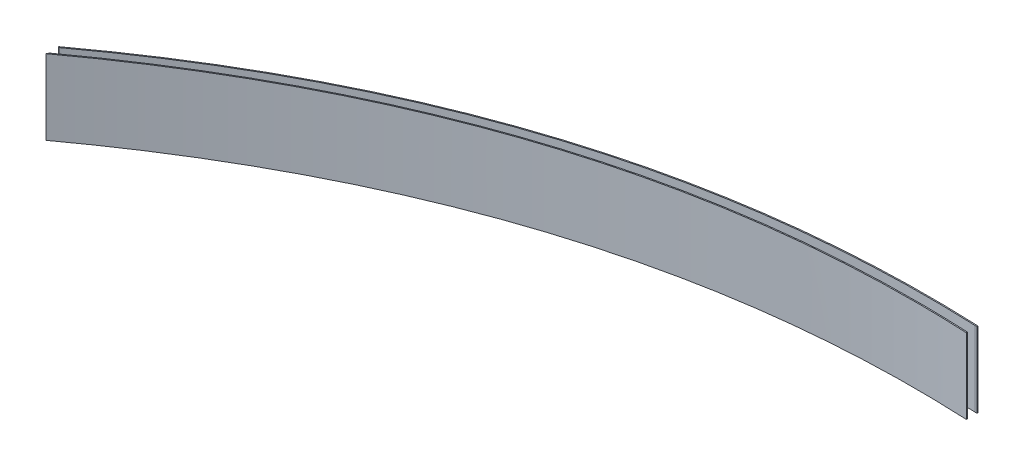
ISO-10303-21;
HEADER;
FILE_DESCRIPTION(('STEP AP214'),'2;1');
FILE_NAME('part.step','',(''),(''),'','','');
FILE_SCHEMA(('AUTOMOTIVE_DESIGN { 1 0 10303 214 1 1 1 1 }'));
ENDSEC;
DATA;
#1=APPLICATION_CONTEXT('core data for automotive mechanical design processes');
#2=APPLICATION_PROTOCOL_DEFINITION('international standard','automotive_design',2000,#1);
#3=PRODUCT_CONTEXT('',#1,'mechanical');
#4=PRODUCT('Part','Part','',(#3));
#5=PRODUCT_RELATED_PRODUCT_CATEGORY('part','',(#4));
#6=PRODUCT_DEFINITION_FORMATION('','',#4);
#7=PRODUCT_DEFINITION_CONTEXT('part definition',#1,'design');
#8=PRODUCT_DEFINITION('design','',#6,#7);
#9=PRODUCT_DEFINITION_SHAPE('','',#8);
#10=(LENGTH_UNIT() NAMED_UNIT(*) SI_UNIT(.MILLI.,.METRE.));
#11=(NAMED_UNIT(*) PLANE_ANGLE_UNIT() SI_UNIT($,.RADIAN.));
#12=(NAMED_UNIT(*) SI_UNIT($,.STERADIAN.) SOLID_ANGLE_UNIT());
#13=UNCERTAINTY_MEASURE_WITH_UNIT(LENGTH_MEASURE(1.E-05),#10,'distance_accuracy_value','');
#14=(GEOMETRIC_REPRESENTATION_CONTEXT(3) GLOBAL_UNCERTAINTY_ASSIGNED_CONTEXT((#13)) GLOBAL_UNIT_ASSIGNED_CONTEXT((#10,
#11,#12)) REPRESENTATION_CONTEXT('',''));
#15=CARTESIAN_POINT('',(0.,0.,0.));
#16=DIRECTION('',(0.,0.,1.));
#17=DIRECTION('',(1.,0.,0.));
#18=AXIS2_PLACEMENT_3D('',#15,#16,#17);
#19=CARTESIAN_POINT('',(-236.084098565073,705.3,330.26408566738));
#20=DIRECTION('',(0.,1.,0.));
#21=DIRECTION('',(0.,0.,1.));
#22=AXIS2_PLACEMENT_3D('',#19,#20,#21);
#23=PLANE('',#22);
#24=CARTESIAN_POINT('',(-65.6029870038505,705.3,318.310693139276));
#25=CARTESIAN_POINT('',(-68.2691629825036,705.3,318.183187046416));
#26=CARTESIAN_POINT('',(-70.9361555522906,705.3,318.073376106954));
#27=CARTESIAN_POINT('',(-76.2713852542856,705.3,317.889522387255));
#28=CARTESIAN_POINT('',(-78.9396223923947,705.3,317.815479778372));
#29=CARTESIAN_POINT('',(-86.9473862895726,705.3,317.647534916938));
#30=CARTESIAN_POINT('',(-92.2881597578225,705.3,317.607902482869));
#31=CARTESIAN_POINT('',(-102.969854987151,705.3,317.676073655154));
#32=CARTESIAN_POINT('',(-108.310776538044,705.3,317.783908630168));
#33=CARTESIAN_POINT('',(-118.988092612427,705.3,318.149436114162));
#34=CARTESIAN_POINT('',(-124.324486600366,705.3,318.407144392248));
#35=CARTESIAN_POINT('',(-134.987971328782,705.3,319.07437400729));
#36=CARTESIAN_POINT('',(-140.315061744115,705.3,319.483900547421));
#37=CARTESIAN_POINT('',(-150.955217209216,705.3,320.456234020843));
#38=CARTESIAN_POINT('',(-156.268282363942,705.3,321.01903980378));
#39=CARTESIAN_POINT('',(-166.725987822131,705.3,322.280831390952));
#40=CARTESIAN_POINT('',(-171.871146588405,705.3,322.975521744442));
#41=CARTESIAN_POINT('',(-182.139119469575,705.3,324.510919792214));
#42=CARTESIAN_POINT('',(-187.261935758724,705.3,325.351612937876));
#43=CARTESIAN_POINT('',(-197.480920878812,705.3,327.178919893074));
#44=CARTESIAN_POINT('',(-202.577092472965,705.3,328.165518247619));
#45=CARTESIAN_POINT('',(-212.738589982239,705.3,330.284063891744));
#46=CARTESIAN_POINT('',(-217.803919000081,705.3,331.415996299166));
#47=CARTESIAN_POINT('',(-227.899635885535,705.3,333.824165958377));
#48=CARTESIAN_POINT('',(-232.930027115684,705.3,335.100389112966));
#49=CARTESIAN_POINT('',(-242.95185071161,705.3,337.795614070396));
#50=CARTESIAN_POINT('',(-247.943286938129,705.3,339.214601525475));
#51=CARTESIAN_POINT('',(-258.337345800253,705.3,342.329437078258));
#52=CARTESIAN_POINT('',(-263.735942949794,705.3,344.038732873943));
#53=CARTESIAN_POINT('',(-274.478583579159,705.3,347.622282235918));
#54=CARTESIAN_POINT('',(-279.822622351469,705.3,349.496549904616));
#55=CARTESIAN_POINT('',(-290.452310891855,705.3,353.406660143415));
#56=CARTESIAN_POINT('',(-295.737950192759,705.3,355.442531159847));
#57=CARTESIAN_POINT('',(-306.247175913095,705.3,359.671966618089));
#58=CARTESIAN_POINT('',(-311.470747397068,705.3,361.865568153882));
#59=CARTESIAN_POINT('',(-321.852374785991,705.3,366.406113074929));
#60=CARTESIAN_POINT('',(-327.010413603648,705.3,368.753095511605));
#61=CARTESIAN_POINT('',(-337.25768706161,705.3,373.595592323015));
#62=CARTESIAN_POINT('',(-342.346905760605,705.3,376.091140411643));
#63=CARTESIAN_POINT('',(-352.613968550303,705.3,381.307086611694));
#64=CARTESIAN_POINT('',(-357.78945789645,705.3,384.032118792804));
#65=CARTESIAN_POINT('',(-368.060581589295,705.3,389.628462780461));
#66=CARTESIAN_POINT('',(-373.156217142842,705.3,392.499772373491));
#67=CARTESIAN_POINT('',(-383.264815106663,705.3,398.382127543981));
#68=CARTESIAN_POINT('',(-388.277793355456,705.3,401.393145919068));
#69=CARTESIAN_POINT('',(-398.218479836666,705.3,407.548011019785));
#70=CARTESIAN_POINT('',(-403.146224129469,705.3,410.691799535078));
#71=CARTESIAN_POINT('',(-412.914028216126,705.3,417.104955927536));
#72=CARTESIAN_POINT('',(-417.754150109865,705.3,420.37422929732));
#73=CARTESIAN_POINT('',(-427.344583874759,705.3,427.030819664629));
#74=CARTESIAN_POINT('',(-432.094989578501,705.3,430.418001436099));
#75=CARTESIAN_POINT('',(-436.802987231457,705.3,433.862922308594));
#76=B_SPLINE_CURVE_WITH_KNOTS('',3,(#24,#25,#26,#27,#28,#29,#30,#31,#32,#33,#34,#35,#36,#37,#38,
#39,#40,#41,#42,#43,#44,#45,#46,#47,#48,#49,#50,#51,#52,#53,#54,#55,#56,#57,#58,#59,#60,#61,#62,
#63,#64,#65,#66,#67,#68,#69,#70,#71,#72,#73,#74,#75),.UNSPECIFIED.,.F.,.F.,(4,2,2,2,2,2,2,2,2,2,
2,2,2,2,2,2,2,2,2,2,2,2,2,2,2,4),(0.,8.00754857334855,16.0151355077293,32.0357311751262,
48.0597352075981,64.0854255306863,80.1116651432765,96.1377844827726,111.711241231546,
127.283147034395,142.853404564952,158.422068976126,173.989213641732,189.554795374637,
206.540261002934,223.527180024817,240.517095839147,257.511020376539,274.509288623075,
291.511429087807,309.056157780186,326.600621058968,344.141682514485,361.675131707691,
379.195625386035,396.696647608506),.UNSPECIFIED.);
#77=CARTESIAN_POINT('',(-65.6029870038505,705.3,318.310693139276));
#78=VERTEX_POINT('',#77);
#79=CARTESIAN_POINT('',(-436.80298723145,705.3,433.862922308592));
#80=VERTEX_POINT('',#79);
#81=EDGE_CURVE('E131',#78,#80,#76,.T.);
#82=ORIENTED_EDGE('',*,*,#81,.T.);
#83=DIRECTION('',(0.452856269308282,0.,-0.891583534700022));
#84=VECTOR('',#83,1.);
#85=CARTESIAN_POINT('',(-353.810815566412,705.3,270.467914266485));
#86=LINE('',#85,#84);
#87=CARTESIAN_POINT('',(-436.202987182509,705.3,432.681642064262));
#88=VERTEX_POINT('',#87);
#89=EDGE_CURVE('E63',#80,#88,#86,.T.);
#90=ORIENTED_EDGE('',*,*,#89,.T.);
#91=CARTESIAN_POINT('',(179399.129928406,705.3,984620.675822957));
#92=CARTESIAN_POINT('',(-212077.093758222,705.3,-976969.386915229));
#93=CARTESIAN_POINT('',(243907.016921872,705.3,970636.245329767));
#94=B_SPLINE_CURVE_WITH_KNOTS('',2,(#91,#92,#93),.UNSPECIFIED.,.F.,.F.,(3,3),(0.,1.),.UNSPECIFIED.);
#95=CARTESIAN_POINT('',(-66.5668764567506,705.3,317.664729887484));
#96=VERTEX_POINT('',#95);
#97=EDGE_CURVE('E162',#96,#88,#94,.F.);
#98=ORIENTED_EDGE('',*,*,#97,.F.);
#99=CARTESIAN_POINT('',(-66.564204214343,705.3,317.664854082143));
#100=VERTEX_POINT('',#99);
#101=EDGE_CURVE('E161',#100,#96,#94,.F.);
#102=ORIENTED_EDGE('',*,*,#101,.F.);
#103=DIRECTION('',(0.998921745490793,0.,0.0464257082404532));
#104=VECTOR('',#103,1.);
#105=CARTESIAN_POINT('',(-66.564204214343,705.3,317.664854082143));
#106=LINE('',#105,#104);
#107=CARTESIAN_POINT('',(-66.2029870059553,705.3,317.681641948464));
#108=VERTEX_POINT('',#107);
#109=EDGE_CURVE('E177',#100,#108,#106,.T.);
#110=ORIENTED_EDGE('',*,*,#109,.T.);
#111=DIRECTION('',(1.,0.,0.));
#112=VECTOR('',#111,1.);
#113=CARTESIAN_POINT('',(-236.084098565073,705.3,317.681641948464));
#114=LINE('',#113,#112);
#115=CARTESIAN_POINT('',(-65.6029870059495,705.3,317.681641948464));
#116=VERTEX_POINT('',#115);
#117=EDGE_CURVE('E97',#108,#116,#114,.T.);
#118=ORIENTED_EDGE('',*,*,#117,.T.);
#119=DIRECTION('',(3.33598704164609E-09,0.,1.));
#120=VECTOR('',#119,1.);
#121=CARTESIAN_POINT('',(-65.6029870059495,705.3,317.681641946463));
#122=LINE('',#121,#120);
#123=EDGE_CURVE('E120',#116,#78,#122,.T.);
#124=ORIENTED_EDGE('',*,*,#123,.T.);
#125=EDGE_LOOP('',(#82,#90,#98,#102,#110,#118,#124));
#126=FACE_BOUND('',#125,.T.);
#127=ADVANCED_FACE('F45',(#126),#23,.F.);
#128=CARTESIAN_POINT('',(-212.010166541518,745.,329.536830566326));
#129=DIRECTION('',(0.,1.,0.));
#130=DIRECTION('',(0.,0.,1.));
#131=AXIS2_PLACEMENT_3D('',#128,#129,#130);
#132=PLANE('',#131);
#133=DIRECTION('',(0.452856269308282,0.,-0.891583534700022));
#134=VECTOR('',#133,1.);
#135=CARTESIAN_POINT('',(-436.202987182509,745.,432.681642064262));
#136=LINE('',#135,#134);
#137=CARTESIAN_POINT('',(-436.80298723145,745.,433.862922308592));
#138=VERTEX_POINT('',#137);
#139=CARTESIAN_POINT('',(-436.202987182509,745.,432.681642064262));
#140=VERTEX_POINT('',#139);
#141=EDGE_CURVE('E12',#138,#140,#136,.T.);
#142=ORIENTED_EDGE('',*,*,#141,.F.);
#143=CARTESIAN_POINT('',(-436.80298723145,745.,433.862922308592));
#144=CARTESIAN_POINT('',(-432.279255756403,745.,430.55283592515));
#145=CARTESIAN_POINT('',(-427.716380805868,745.,427.296059412836));
#146=CARTESIAN_POINT('',(-418.50825169473,745.,420.891282643582));
#147=CARTESIAN_POINT('',(-413.86292067398,745.,417.743392916555));
#148=CARTESIAN_POINT('',(-404.491646218644,745.,411.563075128013));
#149=CARTESIAN_POINT('',(-399.765651911941,745.,408.530724147033));
#150=CARTESIAN_POINT('',(-390.235068970205,745.,402.587926236768));
#151=CARTESIAN_POINT('',(-385.430450818185,745.,399.677526621532));
#152=CARTESIAN_POINT('',(-375.744798513768,745.,393.984783776664));
#153=CARTESIAN_POINT('',(-370.863751469657,745.,391.20246246949));
#154=CARTESIAN_POINT('',(-361.027611925824,745.,385.771719612806));
#155=CARTESIAN_POINT('',(-356.072518596553,745.,383.123299564861));
#156=CARTESIAN_POINT('',(-346.238770653325,745.,378.042292576845));
#157=CARTESIAN_POINT('',(-341.362222313244,745.,375.605630019498));
#158=CARTESIAN_POINT('',(-331.544616363603,745.,370.868404442039));
#159=CARTESIAN_POINT('',(-326.603571709451,745.,368.567814587249));
#160=CARTESIAN_POINT('',(-316.659747663615,745.,364.107101569605));
#161=CARTESIAN_POINT('',(-311.656981986963,745.,361.946947846233));
#162=CARTESIAN_POINT('',(-301.592643904598,745.,357.771088333706));
#163=CARTESIAN_POINT('',(-296.531083180593,745.,355.755354402228));
#164=CARTESIAN_POINT('',(-286.352250622464,745.,351.871919508155));
#165=CARTESIAN_POINT('',(-281.234986407354,745.,350.004198582943));
#166=CARTESIAN_POINT('',(-270.948010590076,745.,346.419961853068));
#167=CARTESIAN_POINT('',(-265.778301322965,745.,344.703439349132));
#168=CARTESIAN_POINT('',(-255.429941826647,745.,341.436991397288));
#169=CARTESIAN_POINT('',(-250.251661926368,745.,339.885892915898));
#170=CARTESIAN_POINT('',(-239.850713429572,745.,336.937627705568));
#171=CARTESIAN_POINT('',(-234.628039042734,745.,335.54048139885));
#172=CARTESIAN_POINT('',(-224.142786614678,745.,332.902097236991));
#173=CARTESIAN_POINT('',(-218.880203866106,745.,331.660878087223));
#174=CARTESIAN_POINT('',(-208.319742254665,745.,329.335763154947));
#175=CARTESIAN_POINT('',(-203.021859272459,745.,328.251886081979));
#176=CARTESIAN_POINT('',(-192.395526399523,745.,326.24230965986));
#177=CARTESIAN_POINT('',(-187.06707294104,745.,325.316629177942));
#178=CARTESIAN_POINT('',(-176.384459892603,745.,323.623741533817));
#179=CARTESIAN_POINT('',(-171.03029752171,745.,322.856551929623));
#180=CARTESIAN_POINT('',(-160.139781371167,745.,321.459677679548));
#181=CARTESIAN_POINT('',(-154.602805468541,745.,320.834841283108));
#182=CARTESIAN_POINT('',(-143.512527106277,745.,319.752161807083));
#183=CARTESIAN_POINT('',(-137.959224503256,745.,319.294320198505));
#184=CARTESIAN_POINT('',(-126.841646292097,745.,318.544085155538));
#185=CARTESIAN_POINT('',(-121.277371038054,745.,318.251686467104));
#186=CARTESIAN_POINT('',(-110.143266246472,745.,317.830220995766));
#187=CARTESIAN_POINT('',(-104.573437348723,745.,317.701137181789));
#188=CARTESIAN_POINT('',(-93.4335333401742,745.,317.603642572535));
#189=CARTESIAN_POINT('',(-87.863458546735,745.,317.635196817593));
#190=CARTESIAN_POINT('',(-79.5119150084561,745.,317.800639622011));
#191=CARTESIAN_POINT('',(-76.7291522792474,745.,317.875448867259));
#192=CARTESIAN_POINT('',(-71.1649597337781,745.,318.063987860901));
#193=CARTESIAN_POINT('',(-68.3835299103828,745.,318.177717398576));
#194=CARTESIAN_POINT('',(-65.6029870038505,745.,318.310693139276));
#195=B_SPLINE_CURVE_WITH_KNOTS('',3,(#143,#144,#145,#146,#147,#148,#149,#150,#151,#152,#153,
#154,#155,#156,#157,#158,#159,#160,#161,#162,#163,#164,#165,#166,#167,#168,#169,#170,#171,#172,
#173,#174,#175,#176,#177,#178,#179,#180,#181,#182,#183,#184,#185,#186,#187,#188,#189,#190,#191,
#192,#193,#194),.UNSPECIFIED.,.F.,.F.,(4,2,2,2,2,2,2,2,2,2,2,2,2,2,2,2,2,2,2,2,2,2,2,2,2,4),(0.,
16.8160550823314,33.6487068955703,50.4923985401429,67.3425657215014,84.1956064097527,
101.04883604582,117.401086820433,133.750101967623,150.095547389379,166.437798948294,
182.777842652134,199.117161999722,215.331599508683,231.548185329037,247.766714673516,
263.987170985665,280.209560473995,296.433746156341,313.147539689226,329.861480445417,
346.574890379593,363.286557234338,379.994587284088,388.345657910788,396.696683324666),.UNSPECIFIED.);
#196=CARTESIAN_POINT('',(-65.6029870038505,745.,318.310693139276));
#197=VERTEX_POINT('',#196);
#198=EDGE_CURVE('E113',#138,#197,#195,.T.);
#199=ORIENTED_EDGE('',*,*,#198,.T.);
#200=DIRECTION('',(-3.33598704164609E-09,0.,-1.));
#201=VECTOR('',#200,1.);
#202=CARTESIAN_POINT('',(-65.6029869664008,745.,329.536830077914));
#203=LINE('',#202,#201);
#204=CARTESIAN_POINT('',(-65.6029870038505,745.,317.681641948464));
#205=VERTEX_POINT('',#204);
#206=EDGE_CURVE('E49',#197,#205,#203,.T.);
#207=ORIENTED_EDGE('',*,*,#206,.T.);
#208=DIRECTION('',(1.,0.,0.));
#209=VECTOR('',#208,1.);
#210=CARTESIAN_POINT('',(-66.2029870059495,745.,317.681641948464));
#211=LINE('',#210,#209);
#212=CARTESIAN_POINT('',(-66.2029870059495,745.,317.681641948464));
#213=VERTEX_POINT('',#212);
#214=EDGE_CURVE('E179',#213,#205,#211,.T.);
#215=ORIENTED_EDGE('',*,*,#214,.F.);
#216=DIRECTION('',(0.998921745490792,0.,0.0464257082404641));
#217=VECTOR('',#216,1.);
#218=CARTESIAN_POINT('',(-66.5642042129753,745.,317.664854082207));
#219=LINE('',#218,#217);
#220=CARTESIAN_POINT('',(-66.5668764558678,745.,317.664729884103));
#221=VERTEX_POINT('',#220);
#222=EDGE_CURVE('E122',#213,#221,#219,.F.);
#223=ORIENTED_EDGE('',*,*,#222,.T.);
#224=CARTESIAN_POINT('',(179399.129928406,745.,984620.675822957));
#225=CARTESIAN_POINT('',(-212077.093758222,745.,-976969.386915229));
#226=CARTESIAN_POINT('',(243907.016921872,745.,970636.245329767));
#227=B_SPLINE_CURVE_WITH_KNOTS('',2,(#224,#225,#226),.UNSPECIFIED.,.F.,.F.,(3,3),(0.,1.),.UNSPECIFIED.);
#228=EDGE_CURVE('E115',#140,#221,#227,.T.);
#229=ORIENTED_EDGE('',*,*,#228,.F.);
#230=EDGE_LOOP('',(#142,#199,#207,#215,#223,#229));
#231=FACE_BOUND('',#230,.T.);
#232=ADVANCED_FACE('F111',(#231),#132,.T.);
#233=CARTESIAN_POINT('',(179399.129928406,314.960432392313,984620.675822957));
#234=CARTESIAN_POINT('',(-212077.093758222,314.960432392313,-976969.386915229));
#235=CARTESIAN_POINT('',(243907.016921872,314.960432392313,970636.245329767));
#236=B_SPLINE_CURVE_WITH_KNOTS('',2,(#233,#234,#235),.UNSPECIFIED.,.F.,.F.,(3,3),(0.,1.),.UNSPECIFIED.);
#237=DIRECTION('',(0.,1.,0.));
#238=VECTOR('',#237,1.);
#239=SURFACE_OF_LINEAR_EXTRUSION('',#236,#238);
#240=OFFSET_SURFACE('',#239,0.6,.F.);
#241=ORIENTED_EDGE('',*,*,#81,.F.);
#242=DIRECTION('',(0.,1.,0.));
#243=VECTOR('',#242,1.);
#244=CARTESIAN_POINT('',(-65.6029870038505,705.3,318.310693139276));
#245=LINE('',#244,#243);
#246=EDGE_CURVE('E118',#78,#197,#245,.T.);
#247=ORIENTED_EDGE('',*,*,#246,.T.);
#248=ORIENTED_EDGE('',*,*,#198,.F.);
#249=DIRECTION('',(0.,1.,0.));
#250=VECTOR('',#249,1.);
#251=CARTESIAN_POINT('',(-436.802987231448,705.3,433.862922308592));
#252=LINE('',#251,#250);
#253=EDGE_CURVE('E55',#80,#138,#252,.T.);
#254=ORIENTED_EDGE('',*,*,#253,.F.);
#255=EDGE_LOOP('',(#241,#247,#248,#254));
#256=FACE_BOUND('',#255,.T.);
#257=ADVANCED_FACE('F116',(#256),#240,.T.);
#258=CARTESIAN_POINT('',(-65.6029870059495,314.960432392313,317.681641946463));
#259=DIRECTION('',(1.,0.,-3.33598704164609E-09));
#260=DIRECTION('',(-3.33598704164609E-09,0.,-1.));
#261=AXIS2_PLACEMENT_3D('',#258,#259,#260);
#262=PLANE('',#261);
#263=DIRECTION('',(0.,-1.,0.));
#264=VECTOR('',#263,1.);
#265=CARTESIAN_POINT('',(-65.6029870059495,314.960432392313,317.681641948464));
#266=LINE('',#265,#264);
#267=EDGE_CURVE('E106',#205,#116,#266,.T.);
#268=ORIENTED_EDGE('',*,*,#267,.F.);
#269=ORIENTED_EDGE('',*,*,#206,.F.);
#270=ORIENTED_EDGE('',*,*,#246,.F.);
#271=ORIENTED_EDGE('',*,*,#123,.F.);
#272=EDGE_LOOP('',(#268,#269,#270,#271));
#273=FACE_BOUND('',#272,.T.);
#274=ADVANCED_FACE('F141',(#273),#262,.T.);
#275=CARTESIAN_POINT('',(179399.129928406,314.960432392313,984620.675822957));
#276=CARTESIAN_POINT('',(-212077.093758222,314.960432392313,-976969.386915229));
#277=CARTESIAN_POINT('',(243907.016921872,314.960432392313,970636.245329767));
#278=B_SPLINE_CURVE_WITH_KNOTS('',2,(#275,#276,#277),.UNSPECIFIED.,.F.,.F.,(3,3),(0.,1.),.UNSPECIFIED.);
#279=DIRECTION('',(0.,1.,0.));
#280=VECTOR('',#279,1.);
#281=SURFACE_OF_LINEAR_EXTRUSION('',#278,#280);
#282=ORIENTED_EDGE('',*,*,#228,.T.);
#283=DIRECTION('',(0.,1.,0.));
#284=VECTOR('',#283,1.);
#285=CARTESIAN_POINT('',(-66.5668764567506,685.,317.664729887484));
#286=LINE('',#285,#284);
#287=EDGE_CURVE('E182',#96,#221,#286,.T.);
#288=ORIENTED_EDGE('',*,*,#287,.F.);
#289=ORIENTED_EDGE('',*,*,#97,.T.);
#290=DIRECTION('',(0.,1.,0.));
#291=VECTOR('',#290,1.);
#292=CARTESIAN_POINT('',(-436.202987182509,314.960432392313,432.681642064262));
#293=LINE('',#292,#291);
#294=EDGE_CURVE('E156',#88,#140,#293,.T.);
#295=ORIENTED_EDGE('',*,*,#294,.T.);
#296=EDGE_LOOP('',(#282,#288,#289,#295));
#297=FACE_BOUND('',#296,.T.);
#298=ADVANCED_FACE('F142',(#297),#281,.F.);
#299=CARTESIAN_POINT('',(-66.5668764567506,685.,317.664729887484));
#300=DIRECTION('',(-0.0464257082403459,0.,0.998921745490798));
#301=DIRECTION('',(0.998921745490798,0.,0.0464257082403459));
#302=AXIS2_PLACEMENT_3D('',#299,#300,#301);
#303=PLANE('',#302);
#304=ORIENTED_EDGE('',*,*,#101,.T.);
#305=ORIENTED_EDGE('',*,*,#287,.T.);
#306=ORIENTED_EDGE('',*,*,#222,.F.);
#307=DIRECTION('',(0.,1.,0.));
#308=VECTOR('',#307,1.);
#309=CARTESIAN_POINT('',(-66.2029870059495,685.,317.681641948464));
#310=LINE('',#309,#308);
#311=EDGE_CURVE('E180',#108,#213,#310,.T.);
#312=ORIENTED_EDGE('',*,*,#311,.F.);
#313=ORIENTED_EDGE('',*,*,#109,.F.);
#314=EDGE_LOOP('',(#304,#305,#306,#312,#313));
#315=FACE_BOUND('',#314,.T.);
#316=ADVANCED_FACE('F148',(#315),#303,.F.);
#317=CARTESIAN_POINT('',(-66.2029870059495,685.,317.681641948464));
#318=DIRECTION('',(0.,0.,1.));
#319=DIRECTION('',(1.,0.,0.));
#320=AXIS2_PLACEMENT_3D('',#317,#318,#319);
#321=PLANE('',#320);
#322=ORIENTED_EDGE('',*,*,#311,.T.);
#323=ORIENTED_EDGE('',*,*,#214,.T.);
#324=ORIENTED_EDGE('',*,*,#267,.T.);
#325=ORIENTED_EDGE('',*,*,#117,.F.);
#326=EDGE_LOOP('',(#322,#323,#324,#325));
#327=FACE_BOUND('',#326,.T.);
#328=ADVANCED_FACE('F197',(#327),#321,.F.);
#329=CARTESIAN_POINT('',(-436.202987182509,685.,432.681642064262));
#330=DIRECTION('',(0.891583534700022,0.,0.452856269308282));
#331=DIRECTION('',(0.452856269308282,0.,-0.891583534700022));
#332=AXIS2_PLACEMENT_3D('',#329,#330,#331);
#333=PLANE('',#332);
#334=ORIENTED_EDGE('',*,*,#253,.T.);
#335=ORIENTED_EDGE('',*,*,#141,.T.);
#336=ORIENTED_EDGE('',*,*,#294,.F.);
#337=ORIENTED_EDGE('',*,*,#89,.F.);
#338=EDGE_LOOP('',(#334,#335,#336,#337));
#339=FACE_BOUND('',#338,.T.);
#340=ADVANCED_FACE('F101',(#339),#333,.F.);
#341=CLOSED_SHELL('',(#127,#232,#257,#274,#298,#316,#328,#340));
#342=MANIFOLD_SOLID_BREP('B2',#341);
#343=CARTESIAN_POINT('',(-65.6029870059495,314.960432392313,317.681641946463));
#344=DIRECTION('',(1.,0.,-3.33598704164609E-09));
#345=DIRECTION('',(-3.33598704164609E-09,0.,-1.));
#346=AXIS2_PLACEMENT_3D('',#343,#344,#345);
#347=PLANE('',#346);
#348=DIRECTION('',(0.,1.,0.));
#349=VECTOR('',#348,1.);
#350=CARTESIAN_POINT('',(-65.6029870226558,314.960432392313,312.673734300305));
#351=LINE('',#350,#349);
#352=CARTESIAN_POINT('',(-65.6029870226558,705.3,312.673734300305));
#353=VERTEX_POINT('',#352);
#354=CARTESIAN_POINT('',(-65.6029870038505,745.,312.673734300454));
#355=VERTEX_POINT('',#354);
#356=EDGE_CURVE('E326',#353,#355,#351,.T.);
#357=ORIENTED_EDGE('',*,*,#356,.F.);
#358=DIRECTION('',(3.33598704164609E-09,0.,1.));
#359=VECTOR('',#358,1.);
#360=CARTESIAN_POINT('',(-65.6029870059495,705.3,317.681641946463));
#361=LINE('',#360,#359);
#362=CARTESIAN_POINT('',(-65.6029870245489,705.3,312.107195518563));
#363=VERTEX_POINT('',#362);
#364=EDGE_CURVE('E263',#363,#353,#361,.T.);
#365=ORIENTED_EDGE('',*,*,#364,.F.);
#366=DIRECTION('',(0.,1.,0.));
#367=VECTOR('',#366,1.);
#368=CARTESIAN_POINT('',(-65.6029870245489,705.3,312.107195518563));
#369=LINE('',#368,#367);
#370=CARTESIAN_POINT('',(-65.6029870245519,745.,312.107195518563));
#371=VERTEX_POINT('',#370);
#372=EDGE_CURVE('E370',#363,#371,#369,.T.);
#373=ORIENTED_EDGE('',*,*,#372,.T.);
#374=DIRECTION('',(-3.33598704164609E-09,0.,-1.));
#375=VECTOR('',#374,1.);
#376=CARTESIAN_POINT('',(-65.6029869664008,745.,329.536830077914));
#377=LINE('',#376,#375);
#378=EDGE_CURVE('E371',#355,#371,#377,.T.);
#379=ORIENTED_EDGE('',*,*,#378,.F.);
#380=EDGE_LOOP('',(#357,#365,#373,#379));
#381=FACE_BOUND('',#380,.T.);
#382=ADVANCED_FACE('F256',(#381),#347,.T.);
#383=CARTESIAN_POINT('',(-64.608203727472,685.,312.681641947686));
#384=DIRECTION('',(0.00794886443687775,0.,-0.999968407278032));
#385=DIRECTION('',(-0.999968407278032,0.,-0.00794886443687775));
#386=AXIS2_PLACEMENT_3D('',#383,#384,#385);
#387=PLANE('',#386);
#388=ORIENTED_EDGE('',*,*,#356,.T.);
#389=DIRECTION('',(-0.999968407278032,0.,-0.00794886443687775));
#390=VECTOR('',#389,1.);
#391=CARTESIAN_POINT('',(-64.608203727472,745.,312.681641947686));
#392=LINE('',#391,#390);
#393=CARTESIAN_POINT('',(-66.5668770191505,745.,312.666072207901));
#394=VERTEX_POINT('',#393);
#395=EDGE_CURVE('E270',#355,#394,#392,.T.);
#396=ORIENTED_EDGE('',*,*,#395,.T.);
#397=DIRECTION('',(0.,1.,0.));
#398=VECTOR('',#397,1.);
#399=CARTESIAN_POINT('',(-66.5668764567364,725.15,312.666072231805));
#400=LINE('',#399,#398);
#401=CARTESIAN_POINT('',(-66.5668764567506,705.3,312.666072231795));
#402=VERTEX_POINT('',#401);
#403=EDGE_CURVE('E43',#402,#394,#400,.T.);
#404=ORIENTED_EDGE('',*,*,#403,.F.);
#405=DIRECTION('',(-0.999968407278032,0.,-0.00794886443687775));
#406=VECTOR('',#405,1.);
#407=CARTESIAN_POINT('',(-235.9335079095,705.3,311.319757304493));
#408=LINE('',#407,#406);
#409=EDGE_CURVE('E323',#353,#402,#408,.T.);
#410=ORIENTED_EDGE('',*,*,#409,.F.);
#411=EDGE_LOOP('',(#388,#396,#404,#410));
#412=FACE_BOUND('',#411,.T.);
#413=ADVANCED_FACE('F350',(#412),#387,.F.);
#414=CARTESIAN_POINT('',(285136.696023591,314.960432392313,959317.615852084));
#415=CARTESIAN_POINT('',(-253607.150543159,314.960432392313,-967038.901584155));
#416=CARTESIAN_POINT('',(221133.268668467,314.960432392313,976081.243658898));
#417=B_SPLINE_CURVE_WITH_KNOTS('',2,(#414,#415,#416),.UNSPECIFIED.,.F.,.F.,(3,3),(0.,1.),.UNSPECIFIED.);
#418=DIRECTION('',(0.,1.,0.));
#419=VECTOR('',#418,1.);
#420=SURFACE_OF_LINEAR_EXTRUSION('',#417,#419);
#421=CARTESIAN_POINT('',(285136.696023591,705.3,959317.615852084));
#422=CARTESIAN_POINT('',(-253607.150543159,705.3,-967038.901584155));
#423=CARTESIAN_POINT('',(221133.268668467,705.3,976081.243658898));
#424=B_SPLINE_CURVE_WITH_KNOTS('',2,(#421,#422,#423),.UNSPECIFIED.,.F.,.F.,(3,3),(0.,1.),.UNSPECIFIED.);
#425=CARTESIAN_POINT('',(-436.202986975316,705.3,427.681641912946));
#426=VERTEX_POINT('',#425);
#427=EDGE_CURVE('E312',#426,#402,#424,.F.);
#428=ORIENTED_EDGE('',*,*,#427,.T.);
#429=ORIENTED_EDGE('',*,*,#403,.T.);
#430=CARTESIAN_POINT('',(285136.696023591,745.,959317.615852084));
#431=CARTESIAN_POINT('',(-253607.150543159,745.,-967038.901584155));
#432=CARTESIAN_POINT('',(221133.268668467,745.,976081.243658898));
#433=B_SPLINE_CURVE_WITH_KNOTS('',2,(#430,#431,#432),.UNSPECIFIED.,.F.,.F.,(3,3),(0.,1.),.UNSPECIFIED.);
#434=CARTESIAN_POINT('',(-436.202986975374,745.,427.681641912883));
#435=VERTEX_POINT('',#434);
#436=EDGE_CURVE('E313',#394,#435,#433,.T.);
#437=ORIENTED_EDGE('',*,*,#436,.T.);
#438=DIRECTION('',(0.,1.,0.));
#439=VECTOR('',#438,1.);
#440=CARTESIAN_POINT('',(-436.202986975374,314.960432392313,427.681641912883));
#441=LINE('',#440,#439);
#442=EDGE_CURVE('E302',#426,#435,#441,.T.);
#443=ORIENTED_EDGE('',*,*,#442,.F.);
#444=EDGE_LOOP('',(#428,#429,#437,#443));
#445=FACE_BOUND('',#444,.T.);
#446=ADVANCED_FACE('F322',(#445),#420,.F.);
#447=CARTESIAN_POINT('',(-212.010166541518,745.,329.536830566326));
#448=DIRECTION('',(0.,1.,0.));
#449=DIRECTION('',(0.,0.,1.));
#450=AXIS2_PLACEMENT_3D('',#447,#448,#449);
#451=PLANE('',#450);
#452=DIRECTION('',(-0.892730946928028,0.,-0.450590120172409));
#453=VECTOR('',#452,1.);
#454=CARTESIAN_POINT('',(-436.202986975374,745.,427.681641912883));
#455=LINE('',#454,#453);
#456=CARTESIAN_POINT('',(-436.802986962826,745.,427.378802555315));
#457=VERTEX_POINT('',#456);
#458=EDGE_CURVE('E305',#435,#457,#455,.T.);
#459=ORIENTED_EDGE('',*,*,#458,.F.);
#460=ORIENTED_EDGE('',*,*,#436,.F.);
#461=ORIENTED_EDGE('',*,*,#395,.F.);
#462=ORIENTED_EDGE('',*,*,#378,.T.);
#463=CARTESIAN_POINT('',(-65.6029870245519,745.,312.107195518563));
#464=CARTESIAN_POINT('',(-68.8360655848659,745.,311.96495440707));
#465=CARTESIAN_POINT('',(-72.0701963345177,745.,311.847702251562));
#466=CARTESIAN_POINT('',(-78.5399250136832,745.,311.663890674077));
#467=CARTESIAN_POINT('',(-81.7755229559784,745.,311.597331702551));
#468=CARTESIAN_POINT('',(-91.4870116238964,745.,311.474725307814));
#469=CARTESIAN_POINT('',(-97.9640627894625,745.,311.495905433628));
#470=CARTESIAN_POINT('',(-110.916019717675,745.,311.749375253086));
#471=CARTESIAN_POINT('',(-117.390924154514,745.,311.981731692027));
#472=CARTESIAN_POINT('',(-130.330312835101,745.,312.662159463947));
#473=CARTESIAN_POINT('',(-136.794795612366,745.,313.110258879267));
#474=CARTESIAN_POINT('',(-149.704921693366,745.,314.225842725688));
#475=CARTESIAN_POINT('',(-156.150564782858,745.,314.89332964193));
#476=CARTESIAN_POINT('',(-168.830746909082,745.,316.428093282491));
#477=CARTESIAN_POINT('',(-175.066044665544,745.,317.28910012314));
#478=CARTESIAN_POINT('',(-187.502902508504,745.,319.222078009508));
#479=CARTESIAN_POINT('',(-193.704467648199,745.,320.294016509993));
#480=CARTESIAN_POINT('',(-206.066302262224,745.,322.649348069743));
#481=CARTESIAN_POINT('',(-212.226578159184,745.,323.932707408446));
#482=CARTESIAN_POINT('',(-224.498496892596,745.,326.710404031752));
#483=CARTESIAN_POINT('',(-230.610146348949,745.,328.20471206052));
#484=CARTESIAN_POINT('',(-242.77764624419,745.,331.402837721937));
#485=CARTESIAN_POINT('',(-248.833502703756,745.,333.106632457142));
#486=CARTESIAN_POINT('',(-261.303206849177,745.,336.847515389385));
#487=CARTESIAN_POINT('',(-267.712572620807,745.,338.899559709637));
#488=CARTESIAN_POINT('',(-280.452807413354,745.,343.236946063103));
#489=CARTESIAN_POINT('',(-286.783665511531,745.,345.522320159905));
#490=CARTESIAN_POINT('',(-299.359842608097,745.,350.321362762269));
#491=CARTESIAN_POINT('',(-305.605142185614,745.,352.835082143115));
#492=CARTESIAN_POINT('',(-318.0035593631,745.,358.084740034403));
#493=CARTESIAN_POINT('',(-324.156651845315,745.,360.820737836763));
#494=CARTESIAN_POINT('',(-336.364426133074,745.,366.507845131743));
#495=CARTESIAN_POINT('',(-342.419082793259,745.,369.459008564271));
#496=CARTESIAN_POINT('',(-354.613126433797,745.,375.664526043001));
#497=CARTESIAN_POINT('',(-360.749134311021,745.,378.925518160327));
#498=CARTESIAN_POINT('',(-372.90424055894,745.,385.657816073886));
#499=CARTESIAN_POINT('',(-378.923343885706,745.,389.12911292861));
#500=CARTESIAN_POINT('',(-390.839530252551,745.,396.271325078874));
#501=CARTESIAN_POINT('',(-396.736646717361,745.,399.942184666095));
#502=CARTESIAN_POINT('',(-408.404397200775,745.,407.472123920745));
#503=CARTESIAN_POINT('',(-414.175106467215,745.,411.33108694291));
#504=CARTESIAN_POINT('',(-422.734475326974,745.,417.252375584052));
#505=CARTESIAN_POINT('',(-425.570058564693,745.,419.247226242331));
#506=CARTESIAN_POINT('',(-431.209965781376,745.,423.280573146121));
#507=CARTESIAN_POINT('',(-434.014290122211,745.,425.319068885572));
#508=CARTESIAN_POINT('',(-436.802986962826,745.,427.378802555315));
#509=B_SPLINE_CURVE_WITH_KNOTS('',3,(#463,#464,#465,#466,#467,#468,#469,#470,#471,#472,#473,
#474,#475,#476,#477,#478,#479,#480,#481,#482,#483,#484,#485,#486,#487,#488,#489,#490,#491,#492,
#493,#494,#495,#496,#497,#498,#499,#500,#501,#502,#503,#504,#505,#506,#507,#508),.UNSPECIFIED.,
.F.,.F.,(4,2,2,2,2,2,2,2,2,2,2,2,2,2,2,2,2,2,2,2,2,2,4),(0.,9.70842084142319,19.4169279493336,
38.8445510406184,58.2783166464797,77.7146125465992,97.151128621337,116.030950401179,
134.907861441507,153.781764619089,172.653052799137,191.522280128832,211.707236019532,
231.89496941882,252.087211724763,272.284858031249,292.48758521538,313.329439794875,
334.170408864022,355.005589715533,375.828010822125,386.228600761917,396.6290701731),.UNSPECIFIED.);
#510=EDGE_CURVE('E320',#371,#457,#509,.T.);
#511=ORIENTED_EDGE('',*,*,#510,.T.);
#512=EDGE_LOOP('',(#459,#460,#461,#462,#511));
#513=FACE_BOUND('',#512,.T.);
#514=ADVANCED_FACE('F318',(#513),#451,.T.);
#515=CARTESIAN_POINT('',(285136.696023591,314.960432392313,959317.615852084));
#516=CARTESIAN_POINT('',(-253607.150543159,314.960432392313,-967038.901584155));
#517=CARTESIAN_POINT('',(221133.268668467,314.960432392313,976081.243658898));
#518=B_SPLINE_CURVE_WITH_KNOTS('',2,(#515,#516,#517),.UNSPECIFIED.,.F.,.F.,(3,3),(0.,1.),.UNSPECIFIED.);
#519=DIRECTION('',(0.,1.,0.));
#520=VECTOR('',#519,1.);
#521=SURFACE_OF_LINEAR_EXTRUSION('',#518,#520);
#522=OFFSET_SURFACE('',#521,0.6,.F.);
#523=CARTESIAN_POINT('',(-436.802986962826,705.3,427.378802555315));
#524=CARTESIAN_POINT('',(-432.357573914022,705.3,424.095380200365));
#525=CARTESIAN_POINT('',(-427.872237236557,705.3,420.865836271993));
#526=CARTESIAN_POINT('',(-418.818627721933,705.3,414.516948944963));
#527=CARTESIAN_POINT('',(-414.250288312721,705.3,411.397700501685));
#528=CARTESIAN_POINT('',(-405.032523436767,705.3,405.275700479121));
#529=CARTESIAN_POINT('',(-400.3830546593,705.3,402.273014066987));
#530=CARTESIAN_POINT('',(-391.005157561634,705.3,396.390146252628));
#531=CARTESIAN_POINT('',(-386.276704610613,705.3,393.510004097315));
#532=CARTESIAN_POINT('',(-376.743144840293,705.3,387.877915826974));
#533=CARTESIAN_POINT('',(-371.938027563969,705.3,385.125987404507));
#534=CARTESIAN_POINT('',(-362.253657075411,705.3,379.755677939082));
#535=CARTESIAN_POINT('',(-357.374403396732,705.3,377.137297736822));
#536=CARTESIAN_POINT('',(-347.688476837849,705.3,372.113746430338));
#537=CARTESIAN_POINT('',(-342.883880461363,705.3,369.704572155707));
#538=CARTESIAN_POINT('',(-333.210395160166,705.3,365.021109531586));
#539=CARTESIAN_POINT('',(-328.341517615143,705.3,362.746797688732));
#540=CARTESIAN_POINT('',(-318.542434110656,705.3,358.336908741613));
#541=CARTESIAN_POINT('',(-313.612240064375,705.3,356.201305174345));
#542=CARTESIAN_POINT('',(-303.693651471857,705.3,352.072273212178));
#543=CARTESIAN_POINT('',(-298.705267122614,705.3,350.078820330333));
#544=CARTESIAN_POINT('',(-288.673599750786,705.3,346.23711422357));
#545=CARTESIAN_POINT('',(-283.630323706244,705.3,344.388842782517));
#546=CARTESIAN_POINT('',(-273.492357977128,705.3,340.840097233906));
#547=CARTESIAN_POINT('',(-268.397671287743,705.3,339.139614571009));
#548=CARTESIAN_POINT('',(-258.057204568689,705.3,335.855788058485));
#549=CARTESIAN_POINT('',(-252.810451781993,705.3,334.275505948789));
#550=CARTESIAN_POINT('',(-242.271259471402,705.3,331.272804524742));
#551=CARTESIAN_POINT('',(-236.978814328544,705.3,329.850404932629));
#552=CARTESIAN_POINT('',(-226.352896276705,705.3,327.164882799336));
#553=CARTESIAN_POINT('',(-221.019417853299,705.3,325.901782077386));
#554=CARTESIAN_POINT('',(-210.316224324602,705.3,323.535704103402));
#555=CARTESIAN_POINT('',(-204.946503879948,705.3,322.432751008904));
#556=CARTESIAN_POINT('',(-194.175737993602,705.3,320.387249576568));
#557=CARTESIAN_POINT('',(-188.774687794206,705.3,319.444726297834));
#558=CARTESIAN_POINT('',(-177.946306240679,705.3,317.719808844371));
#559=CARTESIAN_POINT('',(-172.518971242643,705.3,316.937437562378));
#560=CARTESIAN_POINT('',(-161.476559328314,705.3,315.510469369479));
#561=CARTESIAN_POINT('',(-155.860839527086,705.3,314.87084662983));
#562=CARTESIAN_POINT('',(-144.612838226447,705.3,313.759323138391));
#563=CARTESIAN_POINT('',(-138.980556671698,705.3,313.287422947669));
#564=CARTESIAN_POINT('',(-127.704998046978,705.3,312.509209922284));
#565=CARTESIAN_POINT('',(-122.06172180838,705.3,312.20288502066));
#566=CARTESIAN_POINT('',(-110.769804730855,705.3,311.753137560255));
#567=CARTESIAN_POINT('',(-105.121165112379,705.3,311.609684116282));
#568=CARTESIAN_POINT('',(-93.8240464001927,705.3,311.482475038795));
#569=CARTESIAN_POINT('',(-88.1755679602751,705.3,311.498662775895));
#570=CARTESIAN_POINT('',(-79.7065930225129,705.3,311.639941055241));
#571=CARTESIAN_POINT('',(-76.8849991447583,705.3,311.706498951784));
#572=CARTESIAN_POINT('',(-71.2429977649209,705.3,311.878101623423));
#573=CARTESIAN_POINT('',(-68.4225902558612,705.3,311.983146168928));
#574=CARTESIAN_POINT('',(-65.6029870245489,705.3,312.107195518563));
#575=B_SPLINE_CURVE_WITH_KNOTS('',3,(#523,#524,#525,#526,#527,#528,#529,#530,#531,#532,#533,
#534,#535,#536,#537,#538,#539,#540,#541,#542,#543,#544,#545,#546,#547,#548,#549,#550,#551,#552,
#553,#554,#555,#556,#557,#558,#559,#560,#561,#562,#563,#564,#565,#566,#567,#568,#569,#570,#571,
#572,#573,#574),.UNSPECIFIED.,.F.,.F.,(4,2,2,2,2,2,2,2,2,2,2,2,2,2,2,2,2,2,2,2,2,2,2,2,2,4),(0.,
16.579343528591,33.1726292152399,49.7750620045053,66.3827725892805,82.9927681701557,
99.6028682994412,115.725178476675,131.844671807081,147.96108074447,164.074706721334,
180.186307656916,196.296975286528,212.733223248817,229.171522075587,245.612070022965,
262.055095380917,278.500686783754,294.948627343037,311.902149917432,328.855729204329,
345.808072764746,362.757201127804,379.700317356698,388.167228610641,396.63408935612),.UNSPECIFIED.);
#576=CARTESIAN_POINT('',(-436.802986962826,705.3,427.378802555315));
#577=VERTEX_POINT('',#576);
#578=EDGE_CURVE('E278',#577,#363,#575,.T.);
#579=ORIENTED_EDGE('',*,*,#578,.F.);
#580=DIRECTION('',(0.,1.,0.));
#581=VECTOR('',#580,1.);
#582=CARTESIAN_POINT('',(-436.802986962826,705.3,427.378802555315));
#583=LINE('',#582,#581);
#584=EDGE_CURVE('E341',#577,#457,#583,.T.);
#585=ORIENTED_EDGE('',*,*,#584,.T.);
#586=ORIENTED_EDGE('',*,*,#510,.F.);
#587=ORIENTED_EDGE('',*,*,#372,.F.);
#588=EDGE_LOOP('',(#579,#585,#586,#587));
#589=FACE_BOUND('',#588,.T.);
#590=ADVANCED_FACE('F353',(#589),#522,.T.);
#591=CARTESIAN_POINT('',(-236.084098565073,705.3,330.26408566738));
#592=DIRECTION('',(0.,1.,0.));
#593=DIRECTION('',(0.,0.,1.));
#594=AXIS2_PLACEMENT_3D('',#591,#592,#593);
#595=PLANE('',#594);
#596=ORIENTED_EDGE('',*,*,#427,.F.);
#597=DIRECTION('',(-0.892730946928028,0.,-0.450590120172409));
#598=VECTOR('',#597,1.);
#599=CARTESIAN_POINT('',(-315.901299561853,705.3,488.401786067327));
#600=LINE('',#599,#598);
#601=EDGE_CURVE('E307',#426,#577,#600,.T.);
#602=ORIENTED_EDGE('',*,*,#601,.T.);
#603=ORIENTED_EDGE('',*,*,#578,.T.);
#604=ORIENTED_EDGE('',*,*,#364,.T.);
#605=ORIENTED_EDGE('',*,*,#409,.T.);
#606=EDGE_LOOP('',(#596,#602,#603,#604,#605));
#607=FACE_BOUND('',#606,.T.);
#608=ADVANCED_FACE('F356',(#607),#595,.F.);
#609=CARTESIAN_POINT('',(-436.202986975374,685.,427.681641912883));
#610=DIRECTION('',(0.450590120172409,0.,-0.892730946928028));
#611=DIRECTION('',(-0.892730946928028,0.,-0.450590120172409));
#612=AXIS2_PLACEMENT_3D('',#609,#610,#611);
#613=PLANE('',#612);
#614=ORIENTED_EDGE('',*,*,#442,.T.);
#615=ORIENTED_EDGE('',*,*,#458,.T.);
#616=ORIENTED_EDGE('',*,*,#584,.F.);
#617=ORIENTED_EDGE('',*,*,#601,.F.);
#618=EDGE_LOOP('',(#614,#615,#616,#617));
#619=FACE_BOUND('',#618,.T.);
#620=ADVANCED_FACE('F304',(#619),#613,.F.);
#621=CLOSED_SHELL('',(#382,#413,#446,#514,#590,#608,#620));
#622=MANIFOLD_SOLID_BREP('B6',#621);
#623=ADVANCED_BREP_SHAPE_REPRESENTATION('',(#18,#342,#622),#14);
#624=SHAPE_DEFINITION_REPRESENTATION(#9,#623);
ENDSEC;
END-ISO-10303-21;
